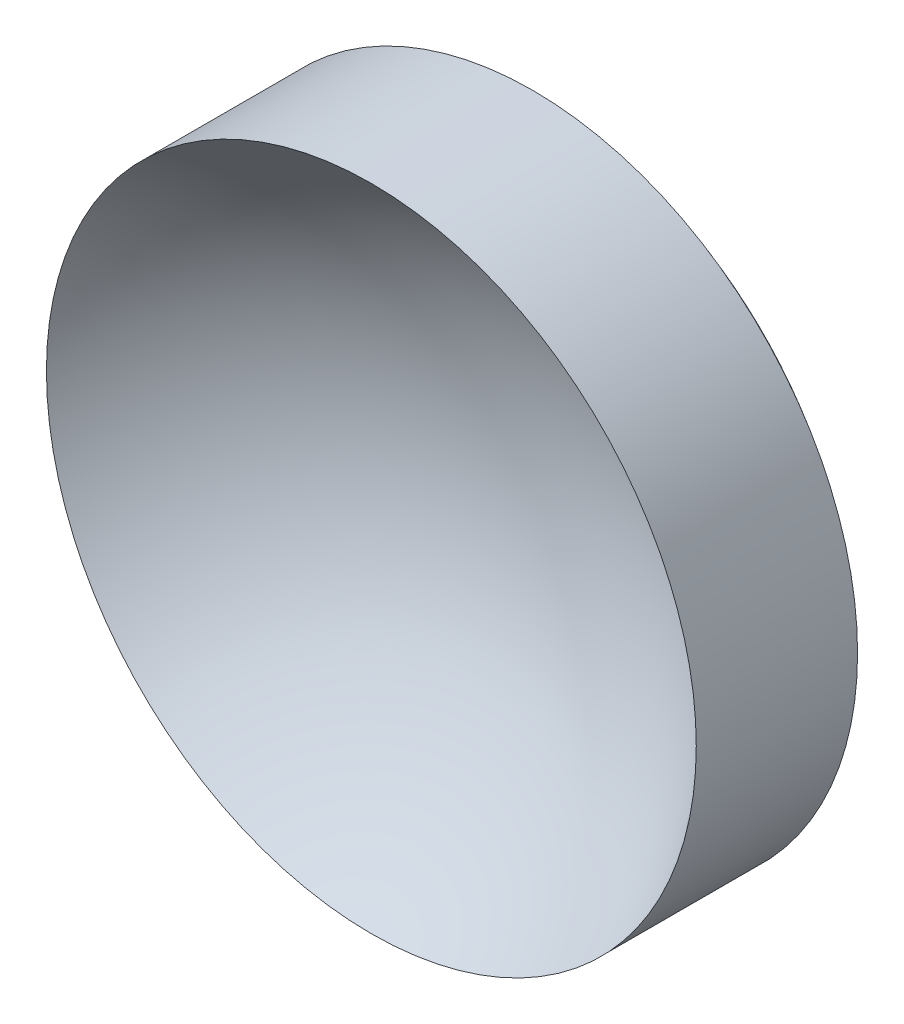
ISO-10303-21;
HEADER;
FILE_DESCRIPTION(('STEP AP214'),'2;1');
FILE_NAME('part.step','',(''),(''),'','','');
FILE_SCHEMA(('AUTOMOTIVE_DESIGN { 1 0 10303 214 1 1 1 1 }'));
ENDSEC;
DATA;
#1=APPLICATION_CONTEXT('core data for automotive mechanical design processes');
#2=APPLICATION_PROTOCOL_DEFINITION('international standard','automotive_design',2000,#1);
#3=PRODUCT_CONTEXT('',#1,'mechanical');
#4=PRODUCT('Part','Part','',(#3));
#5=PRODUCT_RELATED_PRODUCT_CATEGORY('part','',(#4));
#6=PRODUCT_DEFINITION_FORMATION('','',#4);
#7=PRODUCT_DEFINITION_CONTEXT('part definition',#1,'design');
#8=PRODUCT_DEFINITION('design','',#6,#7);
#9=PRODUCT_DEFINITION_SHAPE('','',#8);
#10=(LENGTH_UNIT() NAMED_UNIT(*) SI_UNIT(.MILLI.,.METRE.));
#11=(NAMED_UNIT(*) PLANE_ANGLE_UNIT() SI_UNIT($,.RADIAN.));
#12=(NAMED_UNIT(*) SI_UNIT($,.STERADIAN.) SOLID_ANGLE_UNIT());
#13=UNCERTAINTY_MEASURE_WITH_UNIT(LENGTH_MEASURE(1.E-05),#10,'distance_accuracy_value','');
#14=(GEOMETRIC_REPRESENTATION_CONTEXT(3) GLOBAL_UNCERTAINTY_ASSIGNED_CONTEXT((#13)) GLOBAL_UNIT_ASSIGNED_CONTEXT((#10,
#11,#12)) REPRESENTATION_CONTEXT('',''));
#15=CARTESIAN_POINT('',(0.,0.,0.));
#16=DIRECTION('',(0.,0.,1.));
#17=DIRECTION('',(1.,0.,0.));
#18=AXIS2_PLACEMENT_3D('',#15,#16,#17);
#19=CARTESIAN_POINT('',(0.,0.,17.534));
#20=DIRECTION('',(0.,0.,1.));
#21=DIRECTION('',(0.,1.,0.));
#22=AXIS2_PLACEMENT_3D('',#19,#20,#21);
#23=SPHERICAL_SURFACE('',#22,15.534);
#24=CARTESIAN_POINT('',(0.,0.,8.58888088396806));
#25=DIRECTION('',(0.,0.,1.));
#26=DIRECTION('',(0.,-1.,0.));
#27=AXIS2_PLACEMENT_3D('',#24,#25,#26);
#28=CIRCLE('',#27,12.7);
#29=CARTESIAN_POINT('',(0.,-12.7,8.58888088396806));
#30=VERTEX_POINT('',#29);
#31=EDGE_CURVE('E36',#30,#30,#28,.T.);
#32=ORIENTED_EDGE('',*,*,#31,.T.);
#33=EDGE_LOOP('',(#32));
#34=FACE_BOUND('',#33,.T.);
#35=ADVANCED_FACE('F30',(#34),#23,.F.);
#36=CARTESIAN_POINT('',(0.,0.,18.965));
#37=DIRECTION('',(0.,0.,1.));
#38=DIRECTION('',(0.,-1.,0.));
#39=AXIS2_PLACEMENT_3D('',#36,#37,#38);
#40=SPHERICAL_SURFACE('',#39,20.965);
#41=CARTESIAN_POINT('',(0.,0.,2.28443571098387));
#42=DIRECTION('',(0.,0.,1.));
#43=DIRECTION('',(0.,-1.,0.));
#44=AXIS2_PLACEMENT_3D('',#41,#42,#43);
#45=CIRCLE('',#44,12.7);
#46=CARTESIAN_POINT('',(0.,-12.7,2.28443571098387));
#47=VERTEX_POINT('',#46);
#48=EDGE_CURVE('E10',#47,#47,#45,.T.);
#49=ORIENTED_EDGE('',*,*,#48,.F.);
#50=EDGE_LOOP('',(#49));
#51=FACE_BOUND('',#50,.T.);
#52=ADVANCED_FACE('F45',(#51),#40,.T.);
#53=CARTESIAN_POINT('',(0.,0.,2.));
#54=DIRECTION('',(0.,0.,1.));
#55=DIRECTION('',(0.,-1.,0.));
#56=AXIS2_PLACEMENT_3D('',#53,#54,#55);
#57=CYLINDRICAL_SURFACE('',#56,12.7);
#58=ORIENTED_EDGE('',*,*,#31,.F.);
#59=EDGE_LOOP('',(#58));
#60=FACE_BOUND('',#59,.T.);
#61=ORIENTED_EDGE('',*,*,#48,.T.);
#62=EDGE_LOOP('',(#61));
#63=FACE_BOUND('',#62,.T.);
#64=ADVANCED_FACE('F43',(#60,#63),#57,.T.);
#65=CLOSED_SHELL('',(#35,#52,#64));
#66=MANIFOLD_SOLID_BREP('B2',#65);
#67=ADVANCED_BREP_SHAPE_REPRESENTATION('',(#18,#66),#14);
#68=SHAPE_DEFINITION_REPRESENTATION(#9,#67);
ENDSEC;
END-ISO-10303-21;
